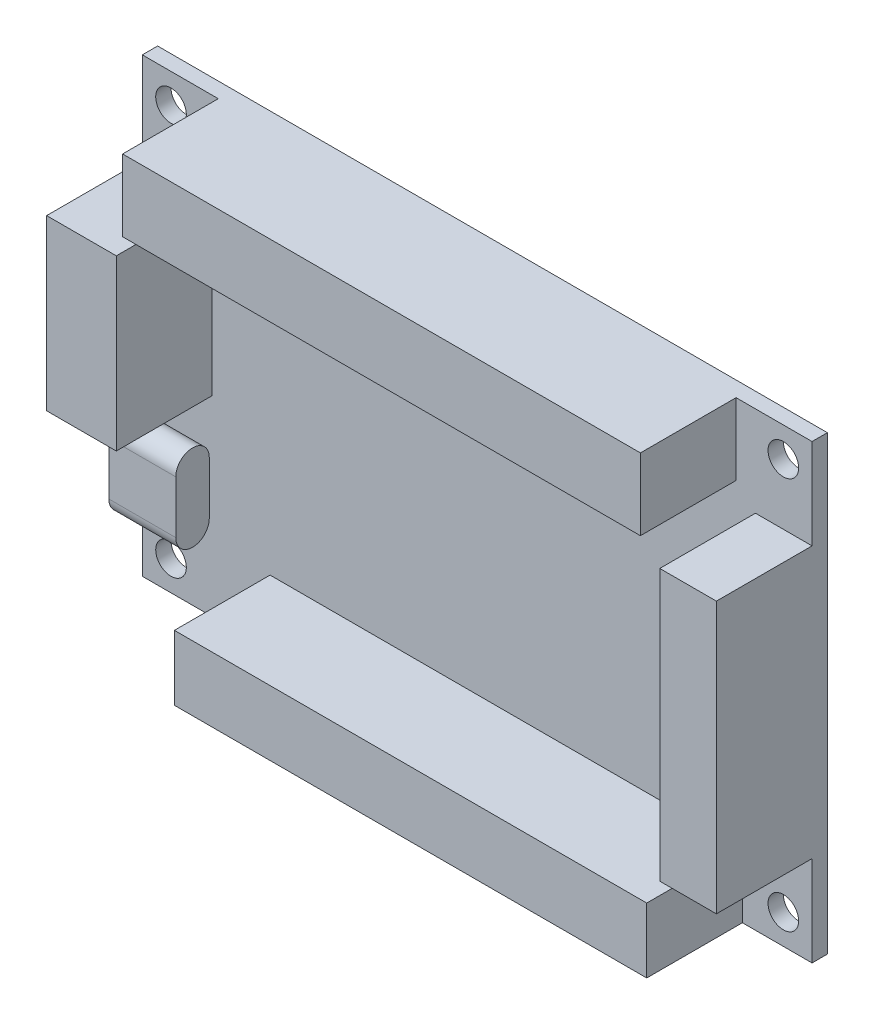
ISO-10303-21;
HEADER;
FILE_DESCRIPTION(('STEP AP214'),'2;1');
FILE_NAME('part.step','',(''),(''),'','','');
FILE_SCHEMA(('AUTOMOTIVE_DESIGN { 1 0 10303 214 1 1 1 1 }'));
ENDSEC;
DATA;
#1=APPLICATION_CONTEXT('core data for automotive mechanical design processes');
#2=APPLICATION_PROTOCOL_DEFINITION('international standard','automotive_design',2000,#1);
#3=PRODUCT_CONTEXT('',#1,'mechanical');
#4=PRODUCT('Part','Part','',(#3));
#5=PRODUCT_RELATED_PRODUCT_CATEGORY('part','',(#4));
#6=PRODUCT_DEFINITION_FORMATION('','',#4);
#7=PRODUCT_DEFINITION_CONTEXT('part definition',#1,'design');
#8=PRODUCT_DEFINITION('design','',#6,#7);
#9=PRODUCT_DEFINITION_SHAPE('','',#8);
#10=(LENGTH_UNIT() NAMED_UNIT(*) SI_UNIT(.MILLI.,.METRE.));
#11=(NAMED_UNIT(*) PLANE_ANGLE_UNIT() SI_UNIT($,.RADIAN.));
#12=(NAMED_UNIT(*) SI_UNIT($,.STERADIAN.) SOLID_ANGLE_UNIT());
#13=UNCERTAINTY_MEASURE_WITH_UNIT(LENGTH_MEASURE(1.E-05),#10,'distance_accuracy_value','');
#14=(GEOMETRIC_REPRESENTATION_CONTEXT(3) GLOBAL_UNCERTAINTY_ASSIGNED_CONTEXT((#13)) GLOBAL_UNIT_ASSIGNED_CONTEXT((#10,
#11,#12)) REPRESENTATION_CONTEXT('',''));
#15=CARTESIAN_POINT('',(0.,0.,0.));
#16=DIRECTION('',(0.,0.,1.));
#17=DIRECTION('',(1.,0.,0.));
#18=AXIS2_PLACEMENT_3D('',#15,#16,#17);
#19=CARTESIAN_POINT('',(0.,0.,1.6));
#20=DIRECTION('',(0.,0.,1.));
#21=DIRECTION('',(1.,0.,0.));
#22=AXIS2_PLACEMENT_3D('',#19,#20,#21);
#23=PLANE('',#22);
#24=DIRECTION('',(-1.,0.,0.));
#25=VECTOR('',#24,1.);
#26=CARTESIAN_POINT('',(-28.,-9.35,1.6));
#27=LINE('',#26,#25);
#28=CARTESIAN_POINT('',(-28.,-9.35,1.6));
#29=VERTEX_POINT('',#28);
#30=CARTESIAN_POINT('',(-35.,-9.35,1.6));
#31=VERTEX_POINT('',#30);
#32=EDGE_CURVE('E53',#29,#31,#27,.T.);
#33=ORIENTED_EDGE('',*,*,#32,.F.);
#34=DIRECTION('',(0.,-1.,0.));
#35=VECTOR('',#34,1.);
#36=CARTESIAN_POINT('',(-28.,-9.35,1.6));
#37=LINE('',#36,#35);
#38=CARTESIAN_POINT('',(-28.,-14.85,1.6));
#39=VERTEX_POINT('',#38);
#40=EDGE_CURVE('E48',#29,#39,#37,.T.);
#41=ORIENTED_EDGE('',*,*,#40,.T.);
#42=DIRECTION('',(-1.,0.,0.));
#43=VECTOR('',#42,1.);
#44=CARTESIAN_POINT('',(-28.,-14.85,1.6));
#45=LINE('',#44,#43);
#46=CARTESIAN_POINT('',(-35.,-14.85,1.6));
#47=VERTEX_POINT('',#46);
#48=EDGE_CURVE('E204',#39,#47,#45,.T.);
#49=ORIENTED_EDGE('',*,*,#48,.T.);
#50=DIRECTION('',(0.,-1.,0.));
#51=VECTOR('',#50,1.);
#52=CARTESIAN_POINT('',(-35.,23.6,1.6));
#53=LINE('',#52,#51);
#54=CARTESIAN_POINT('',(-35.,-23.6,1.6));
#55=VERTEX_POINT('',#54);
#56=EDGE_CURVE('E378',#47,#55,#53,.T.);
#57=ORIENTED_EDGE('',*,*,#56,.T.);
#58=DIRECTION('',(1.,0.,0.));
#59=VECTOR('',#58,1.);
#60=CARTESIAN_POINT('',(-35.,-23.6,1.6));
#61=LINE('',#60,#59);
#62=CARTESIAN_POINT('',(-21.6462553816328,-23.6,1.6));
#63=VERTEX_POINT('',#62);
#64=EDGE_CURVE('E383',#55,#63,#61,.T.);
#65=ORIENTED_EDGE('',*,*,#64,.T.);
#66=DIRECTION('',(0.,-1.,0.));
#67=VECTOR('',#66,1.);
#68=CARTESIAN_POINT('',(-21.6462553816328,-16.8142339307149,1.6));
#69=LINE('',#68,#67);
#70=CARTESIAN_POINT('',(-21.6462553816328,-16.8142339307149,1.6));
#71=VERTEX_POINT('',#70);
#72=EDGE_CURVE('E322',#71,#63,#69,.T.);
#73=ORIENTED_EDGE('',*,*,#72,.F.);
#74=DIRECTION('',(-1.,0.,0.));
#75=VECTOR('',#74,1.);
#76=CARTESIAN_POINT('',(-21.6462553816328,-16.8142339307149,1.6));
#77=LINE('',#76,#75);
#78=CARTESIAN_POINT('',(27.7201934755892,-16.8142339307149,1.6));
#79=VERTEX_POINT('',#78);
#80=EDGE_CURVE('E331',#79,#71,#77,.T.);
#81=ORIENTED_EDGE('',*,*,#80,.F.);
#82=DIRECTION('',(0.,1.,0.));
#83=VECTOR('',#82,1.);
#84=CARTESIAN_POINT('',(27.7201934755892,-16.8142339307149,1.6));
#85=LINE('',#84,#83);
#86=CARTESIAN_POINT('',(27.7201934755892,-23.6,1.6));
#87=VERTEX_POINT('',#86);
#88=EDGE_CURVE('E317',#87,#79,#85,.T.);
#89=ORIENTED_EDGE('',*,*,#88,.F.);
#90=CARTESIAN_POINT('',(35.,-23.6,1.6));
#91=VERTEX_POINT('',#90);
#92=EDGE_CURVE('E381',#87,#91,#61,.T.);
#93=ORIENTED_EDGE('',*,*,#92,.T.);
#94=DIRECTION('',(0.,1.,0.));
#95=VECTOR('',#94,1.);
#96=CARTESIAN_POINT('',(35.,23.6,1.6));
#97=LINE('',#96,#95);
#98=CARTESIAN_POINT('',(35.,-14.1534321184887,1.6));
#99=VERTEX_POINT('',#98);
#100=EDGE_CURVE('E372',#91,#99,#97,.T.);
#101=ORIENTED_EDGE('',*,*,#100,.T.);
#102=DIRECTION('',(1.,0.,0.));
#103=VECTOR('',#102,1.);
#104=CARTESIAN_POINT('',(29.0837837526944,-14.1534321184887,1.6));
#105=LINE('',#104,#103);
#106=CARTESIAN_POINT('',(29.0837837526944,-14.1534321184887,1.6));
#107=VERTEX_POINT('',#106);
#108=EDGE_CURVE('E262',#107,#99,#105,.T.);
#109=ORIENTED_EDGE('',*,*,#108,.F.);
#110=DIRECTION('',(0.,-1.,0.));
#111=VECTOR('',#110,1.);
#112=CARTESIAN_POINT('',(29.0837837526944,-14.1534321184887,1.6));
#113=LINE('',#112,#111);
#114=CARTESIAN_POINT('',(29.0837837526944,14.1534321184887,1.6));
#115=VERTEX_POINT('',#114);
#116=EDGE_CURVE('E271',#115,#107,#113,.T.);
#117=ORIENTED_EDGE('',*,*,#116,.F.);
#118=DIRECTION('',(-1.,0.,0.));
#119=VECTOR('',#118,1.);
#120=CARTESIAN_POINT('',(29.0837837526944,14.1534321184887,1.6));
#121=LINE('',#120,#119);
#122=CARTESIAN_POINT('',(35.,14.1534321184887,1.6));
#123=VERTEX_POINT('',#122);
#124=EDGE_CURVE('E257',#123,#115,#121,.T.);
#125=ORIENTED_EDGE('',*,*,#124,.F.);
#126=CARTESIAN_POINT('',(35.,23.6,1.6));
#127=VERTEX_POINT('',#126);
#128=EDGE_CURVE('E375',#123,#127,#97,.T.);
#129=ORIENTED_EDGE('',*,*,#128,.T.);
#130=DIRECTION('',(-1.,0.,0.));
#131=VECTOR('',#130,1.);
#132=CARTESIAN_POINT('',(-35.,23.6,1.6));
#133=LINE('',#132,#131);
#134=CARTESIAN_POINT('',(27.0601888690275,23.6,1.6));
#135=VERTEX_POINT('',#134);
#136=EDGE_CURVE('E376',#127,#135,#133,.T.);
#137=ORIENTED_EDGE('',*,*,#136,.T.);
#138=DIRECTION('',(0.,1.,0.));
#139=VECTOR('',#138,1.);
#140=CARTESIAN_POINT('',(27.0601888690275,16.1036087033518,1.6));
#141=LINE('',#140,#139);
#142=CARTESIAN_POINT('',(27.0601888690275,16.1036087033518,1.6));
#143=VERTEX_POINT('',#142);
#144=EDGE_CURVE('E287',#143,#135,#141,.T.);
#145=ORIENTED_EDGE('',*,*,#144,.F.);
#146=DIRECTION('',(1.,0.,0.));
#147=VECTOR('',#146,1.);
#148=CARTESIAN_POINT('',(-27.0601888690275,16.1036087033518,1.6));
#149=LINE('',#148,#147);
#150=CARTESIAN_POINT('',(-27.0601888690275,16.1036087033518,1.6));
#151=VERTEX_POINT('',#150);
#152=EDGE_CURVE('E292',#151,#143,#149,.T.);
#153=ORIENTED_EDGE('',*,*,#152,.F.);
#154=DIRECTION('',(0.,-1.,0.));
#155=VECTOR('',#154,1.);
#156=CARTESIAN_POINT('',(-27.0601888690275,16.1036087033518,1.6));
#157=LINE('',#156,#155);
#158=CARTESIAN_POINT('',(-27.0601888690275,23.6,1.6));
#159=VERTEX_POINT('',#158);
#160=EDGE_CURVE('E301',#159,#151,#157,.T.);
#161=ORIENTED_EDGE('',*,*,#160,.F.);
#162=CARTESIAN_POINT('',(-35.,23.6,1.6));
#163=VERTEX_POINT('',#162);
#164=EDGE_CURVE('E374',#159,#163,#133,.T.);
#165=ORIENTED_EDGE('',*,*,#164,.T.);
#166=CARTESIAN_POINT('',(-35.,14.0486711566723,1.6));
#167=VERTEX_POINT('',#166);
#168=EDGE_CURVE('E379',#163,#167,#53,.T.);
#169=ORIENTED_EDGE('',*,*,#168,.T.);
#170=DIRECTION('',(-1.,0.,0.));
#171=VECTOR('',#170,1.);
#172=CARTESIAN_POINT('',(-27.7201934755892,14.0486711566723,1.6));
#173=LINE('',#172,#171);
#174=CARTESIAN_POINT('',(-27.7201934755892,14.0486711566723,1.6));
#175=VERTEX_POINT('',#174);
#176=EDGE_CURVE('E232',#175,#167,#173,.T.);
#177=ORIENTED_EDGE('',*,*,#176,.F.);
#178=DIRECTION('',(0.,1.,0.));
#179=VECTOR('',#178,1.);
#180=CARTESIAN_POINT('',(-27.7201934755892,-3.62126385209027,1.6));
#181=LINE('',#180,#179);
#182=CARTESIAN_POINT('',(-27.7201934755892,-3.62126385209027,1.6));
#183=VERTEX_POINT('',#182);
#184=EDGE_CURVE('E241',#183,#175,#181,.T.);
#185=ORIENTED_EDGE('',*,*,#184,.F.);
#186=DIRECTION('',(1.,0.,0.));
#187=VECTOR('',#186,1.);
#188=CARTESIAN_POINT('',(-27.7201934755892,-3.62126385209027,1.6));
#189=LINE('',#188,#187);
#190=CARTESIAN_POINT('',(-35.,-3.62126385209028,1.6));
#191=VERTEX_POINT('',#190);
#192=EDGE_CURVE('E225',#191,#183,#189,.T.);
#193=ORIENTED_EDGE('',*,*,#192,.F.);
#194=EDGE_CURVE('E382',#191,#31,#53,.T.);
#195=ORIENTED_EDGE('',*,*,#194,.T.);
#196=EDGE_LOOP('',(#33,#41,#49,#57,#65,#73,#81,#89,#93,#101,#109,#117,#125,#129,#137,#145,#153,
#161,#165,#169,#177,#185,#193,#195));
#197=FACE_BOUND('',#196,.T.);
#198=CARTESIAN_POINT('',(32.,-20.5,1.6));
#199=DIRECTION('',(0.,0.,1.));
#200=DIRECTION('',(1.,0.,0.));
#201=AXIS2_PLACEMENT_3D('',#198,#199,#200);
#202=CIRCLE('',#201,1.6);
#203=CARTESIAN_POINT('',(33.6,-20.5,1.6));
#204=VERTEX_POINT('',#203);
#205=EDGE_CURVE('E354',#204,#204,#202,.T.);
#206=ORIENTED_EDGE('',*,*,#205,.F.);
#207=EDGE_LOOP('',(#206));
#208=FACE_BOUND('',#207,.T.);
#209=CARTESIAN_POINT('',(-32.,20.5,1.6));
#210=DIRECTION('',(0.,0.,1.));
#211=DIRECTION('',(1.,0.,0.));
#212=AXIS2_PLACEMENT_3D('',#209,#210,#211);
#213=CIRCLE('',#212,1.6);
#214=CARTESIAN_POINT('',(-30.4,20.5,1.6));
#215=VERTEX_POINT('',#214);
#216=EDGE_CURVE('E366',#215,#215,#213,.T.);
#217=ORIENTED_EDGE('',*,*,#216,.F.);
#218=EDGE_LOOP('',(#217));
#219=FACE_BOUND('',#218,.T.);
#220=CARTESIAN_POINT('',(32.,20.5,1.6));
#221=DIRECTION('',(0.,0.,1.));
#222=DIRECTION('',(-1.,0.,0.));
#223=AXIS2_PLACEMENT_3D('',#220,#221,#222);
#224=CIRCLE('',#223,1.6);
#225=CARTESIAN_POINT('',(30.4,20.5,1.6));
#226=VERTEX_POINT('',#225);
#227=EDGE_CURVE('E360',#226,#226,#224,.T.);
#228=ORIENTED_EDGE('',*,*,#227,.F.);
#229=EDGE_LOOP('',(#228));
#230=FACE_BOUND('',#229,.T.);
#231=CARTESIAN_POINT('',(-32.,-20.5,1.6));
#232=DIRECTION('',(0.,0.,1.));
#233=DIRECTION('',(-1.,0.,0.));
#234=AXIS2_PLACEMENT_3D('',#231,#232,#233);
#235=CIRCLE('',#234,1.6);
#236=CARTESIAN_POINT('',(-33.6,-20.5,1.6));
#237=VERTEX_POINT('',#236);
#238=EDGE_CURVE('E348',#237,#237,#235,.T.);
#239=ORIENTED_EDGE('',*,*,#238,.F.);
#240=EDGE_LOOP('',(#239));
#241=FACE_BOUND('',#240,.T.);
#242=ADVANCED_FACE('F33',(#197,#208,#219,#230,#241),#23,.T.);
#243=CARTESIAN_POINT('',(0.,0.,0.));
#244=DIRECTION('',(0.,0.,1.));
#245=DIRECTION('',(1.,0.,0.));
#246=AXIS2_PLACEMENT_3D('',#243,#244,#245);
#247=PLANE('',#246);
#248=DIRECTION('',(0.,1.,0.));
#249=VECTOR('',#248,1.);
#250=CARTESIAN_POINT('',(35.,23.6,0.));
#251=LINE('',#250,#249);
#252=CARTESIAN_POINT('',(35.,-23.6,0.));
#253=VERTEX_POINT('',#252);
#254=CARTESIAN_POINT('',(35.,23.6,0.));
#255=VERTEX_POINT('',#254);
#256=EDGE_CURVE('E369',#253,#255,#251,.T.);
#257=ORIENTED_EDGE('',*,*,#256,.F.);
#258=DIRECTION('',(1.,0.,0.));
#259=VECTOR('',#258,1.);
#260=CARTESIAN_POINT('',(-35.,-23.6,0.));
#261=LINE('',#260,#259);
#262=CARTESIAN_POINT('',(-35.,-23.6,0.));
#263=VERTEX_POINT('',#262);
#264=EDGE_CURVE('E392',#263,#253,#261,.T.);
#265=ORIENTED_EDGE('',*,*,#264,.F.);
#266=DIRECTION('',(0.,-1.,0.));
#267=VECTOR('',#266,1.);
#268=CARTESIAN_POINT('',(-35.,23.6,0.));
#269=LINE('',#268,#267);
#270=CARTESIAN_POINT('',(-35.,23.6,0.));
#271=VERTEX_POINT('',#270);
#272=EDGE_CURVE('E390',#271,#263,#269,.T.);
#273=ORIENTED_EDGE('',*,*,#272,.F.);
#274=DIRECTION('',(-1.,0.,0.));
#275=VECTOR('',#274,1.);
#276=CARTESIAN_POINT('',(-35.,23.6,0.));
#277=LINE('',#276,#275);
#278=EDGE_CURVE('E388',#255,#271,#277,.T.);
#279=ORIENTED_EDGE('',*,*,#278,.F.);
#280=EDGE_LOOP('',(#257,#265,#273,#279));
#281=FACE_BOUND('',#280,.T.);
#282=CARTESIAN_POINT('',(-32.,20.5,0.));
#283=DIRECTION('',(0.,0.,1.));
#284=DIRECTION('',(1.,0.,0.));
#285=AXIS2_PLACEMENT_3D('',#282,#283,#284);
#286=CIRCLE('',#285,1.6);
#287=CARTESIAN_POINT('',(-30.4,20.5,0.));
#288=VERTEX_POINT('',#287);
#289=EDGE_CURVE('E363',#288,#288,#286,.T.);
#290=ORIENTED_EDGE('',*,*,#289,.T.);
#291=EDGE_LOOP('',(#290));
#292=FACE_BOUND('',#291,.T.);
#293=CARTESIAN_POINT('',(32.,20.5,0.));
#294=DIRECTION('',(0.,0.,1.));
#295=DIRECTION('',(-1.,0.,0.));
#296=AXIS2_PLACEMENT_3D('',#293,#294,#295);
#297=CIRCLE('',#296,1.6);
#298=CARTESIAN_POINT('',(30.4,20.5,0.));
#299=VERTEX_POINT('',#298);
#300=EDGE_CURVE('E357',#299,#299,#297,.T.);
#301=ORIENTED_EDGE('',*,*,#300,.T.);
#302=EDGE_LOOP('',(#301));
#303=FACE_BOUND('',#302,.T.);
#304=CARTESIAN_POINT('',(32.,-20.5,0.));
#305=DIRECTION('',(0.,0.,1.));
#306=DIRECTION('',(1.,0.,0.));
#307=AXIS2_PLACEMENT_3D('',#304,#305,#306);
#308=CIRCLE('',#307,1.6);
#309=CARTESIAN_POINT('',(33.6,-20.5,0.));
#310=VERTEX_POINT('',#309);
#311=EDGE_CURVE('E351',#310,#310,#308,.T.);
#312=ORIENTED_EDGE('',*,*,#311,.T.);
#313=EDGE_LOOP('',(#312));
#314=FACE_BOUND('',#313,.T.);
#315=CARTESIAN_POINT('',(-32.,-20.5,0.));
#316=DIRECTION('',(0.,0.,1.));
#317=DIRECTION('',(-1.,0.,0.));
#318=AXIS2_PLACEMENT_3D('',#315,#316,#317);
#319=CIRCLE('',#318,1.6);
#320=CARTESIAN_POINT('',(-33.6,-20.5,0.));
#321=VERTEX_POINT('',#320);
#322=EDGE_CURVE('E347',#321,#321,#319,.T.);
#323=ORIENTED_EDGE('',*,*,#322,.T.);
#324=EDGE_LOOP('',(#323));
#325=FACE_BOUND('',#324,.T.);
#326=ADVANCED_FACE('F409',(#281,#292,#303,#314,#325),#247,.F.);
#327=CARTESIAN_POINT('',(35.,23.6,1.6));
#328=DIRECTION('',(-1.,0.,0.));
#329=DIRECTION('',(0.,-1.,0.));
#330=AXIS2_PLACEMENT_3D('',#327,#328,#329);
#331=PLANE('',#330);
#332=ORIENTED_EDGE('',*,*,#256,.T.);
#333=DIRECTION('',(0.,0.,-1.));
#334=VECTOR('',#333,1.);
#335=CARTESIAN_POINT('',(35.,23.6,1.6));
#336=LINE('',#335,#334);
#337=EDGE_CURVE('E11',#127,#255,#336,.T.);
#338=ORIENTED_EDGE('',*,*,#337,.F.);
#339=ORIENTED_EDGE('',*,*,#128,.F.);
#340=DIRECTION('',(0.,0.,-1.));
#341=VECTOR('',#340,1.);
#342=CARTESIAN_POINT('',(35.,14.1534321184887,11.6));
#343=LINE('',#342,#341);
#344=CARTESIAN_POINT('',(35.,14.1534321184887,11.6));
#345=VERTEX_POINT('',#344);
#346=EDGE_CURVE('E284',#345,#123,#343,.T.);
#347=ORIENTED_EDGE('',*,*,#346,.F.);
#348=DIRECTION('',(0.,1.,0.));
#349=VECTOR('',#348,1.);
#350=CARTESIAN_POINT('',(35.,-14.1534321184887,11.6));
#351=LINE('',#350,#349);
#352=CARTESIAN_POINT('',(35.,-14.1534321184887,11.6));
#353=VERTEX_POINT('',#352);
#354=EDGE_CURVE('E258',#353,#345,#351,.T.);
#355=ORIENTED_EDGE('',*,*,#354,.F.);
#356=DIRECTION('',(0.,0.,-1.));
#357=VECTOR('',#356,1.);
#358=CARTESIAN_POINT('',(35.,-14.1534321184887,11.6));
#359=LINE('',#358,#357);
#360=EDGE_CURVE('E268',#353,#99,#359,.T.);
#361=ORIENTED_EDGE('',*,*,#360,.T.);
#362=ORIENTED_EDGE('',*,*,#100,.F.);
#363=DIRECTION('',(0.,0.,-1.));
#364=VECTOR('',#363,1.);
#365=CARTESIAN_POINT('',(35.,-23.6,1.6));
#366=LINE('',#365,#364);
#367=EDGE_CURVE('E385',#91,#253,#366,.T.);
#368=ORIENTED_EDGE('',*,*,#367,.T.);
#369=EDGE_LOOP('',(#332,#338,#339,#347,#355,#361,#362,#368));
#370=FACE_BOUND('',#369,.T.);
#371=ADVANCED_FACE('F35',(#370),#331,.F.);
#372=CARTESIAN_POINT('',(-35.,23.6,1.6));
#373=DIRECTION('',(0.,-1.,0.));
#374=DIRECTION('',(0.,0.,-1.));
#375=AXIS2_PLACEMENT_3D('',#372,#373,#374);
#376=PLANE('',#375);
#377=ORIENTED_EDGE('',*,*,#278,.T.);
#378=DIRECTION('',(0.,0.,-1.));
#379=VECTOR('',#378,1.);
#380=CARTESIAN_POINT('',(-35.,23.6,1.6));
#381=LINE('',#380,#379);
#382=EDGE_CURVE('E41',#163,#271,#381,.T.);
#383=ORIENTED_EDGE('',*,*,#382,.F.);
#384=ORIENTED_EDGE('',*,*,#164,.F.);
#385=DIRECTION('',(0.,0.,-1.));
#386=VECTOR('',#385,1.);
#387=CARTESIAN_POINT('',(-27.0601888690275,23.6,11.6));
#388=LINE('',#387,#386);
#389=CARTESIAN_POINT('',(-27.0601888690275,23.6,11.6));
#390=VERTEX_POINT('',#389);
#391=EDGE_CURVE('E311',#390,#159,#388,.T.);
#392=ORIENTED_EDGE('',*,*,#391,.F.);
#393=DIRECTION('',(-1.,0.,0.));
#394=VECTOR('',#393,1.);
#395=CARTESIAN_POINT('',(-27.0601888690275,23.6,11.6));
#396=LINE('',#395,#394);
#397=CARTESIAN_POINT('',(27.0601888690275,23.6,11.6));
#398=VERTEX_POINT('',#397);
#399=EDGE_CURVE('E291',#398,#390,#396,.T.);
#400=ORIENTED_EDGE('',*,*,#399,.F.);
#401=DIRECTION('',(0.,0.,-1.));
#402=VECTOR('',#401,1.);
#403=CARTESIAN_POINT('',(27.0601888690275,23.6,11.6));
#404=LINE('',#403,#402);
#405=EDGE_CURVE('E314',#398,#135,#404,.T.);
#406=ORIENTED_EDGE('',*,*,#405,.T.);
#407=ORIENTED_EDGE('',*,*,#136,.F.);
#408=ORIENTED_EDGE('',*,*,#337,.T.);
#409=EDGE_LOOP('',(#377,#383,#384,#392,#400,#406,#407,#408));
#410=FACE_BOUND('',#409,.T.);
#411=ADVANCED_FACE('F435',(#410),#376,.F.);
#412=CARTESIAN_POINT('',(-35.,23.6,1.6));
#413=DIRECTION('',(1.,0.,0.));
#414=DIRECTION('',(0.,1.,0.));
#415=AXIS2_PLACEMENT_3D('',#412,#413,#414);
#416=PLANE('',#415);
#417=ORIENTED_EDGE('',*,*,#272,.T.);
#418=DIRECTION('',(0.,0.,-1.));
#419=VECTOR('',#418,1.);
#420=CARTESIAN_POINT('',(-35.,-23.6,1.6));
#421=LINE('',#420,#419);
#422=EDGE_CURVE('E396',#55,#263,#421,.T.);
#423=ORIENTED_EDGE('',*,*,#422,.F.);
#424=ORIENTED_EDGE('',*,*,#56,.F.);
#425=CARTESIAN_POINT('',(-35.,-14.85,3.35));
#426=DIRECTION('',(-1.,0.,0.));
#427=DIRECTION('',(0.,0.,1.));
#428=AXIS2_PLACEMENT_3D('',#425,#426,#427);
#429=CIRCLE('',#428,1.75);
#430=CARTESIAN_POINT('',(-35.,-14.85,5.1));
#431=VERTEX_POINT('',#430);
#432=EDGE_CURVE('E222',#47,#431,#429,.T.);
#433=ORIENTED_EDGE('',*,*,#432,.T.);
#434=DIRECTION('',(0.,1.,0.));
#435=VECTOR('',#434,1.);
#436=CARTESIAN_POINT('',(-35.,-9.35,5.1));
#437=LINE('',#436,#435);
#438=CARTESIAN_POINT('',(-35.,-9.35,5.1));
#439=VERTEX_POINT('',#438);
#440=EDGE_CURVE('E199',#431,#439,#437,.T.);
#441=ORIENTED_EDGE('',*,*,#440,.T.);
#442=CARTESIAN_POINT('',(-35.,-9.35,3.35));
#443=DIRECTION('',(-1.,0.,0.));
#444=DIRECTION('',(0.,0.,1.));
#445=AXIS2_PLACEMENT_3D('',#442,#443,#444);
#446=CIRCLE('',#445,1.75);
#447=EDGE_CURVE('E219',#439,#31,#446,.T.);
#448=ORIENTED_EDGE('',*,*,#447,.T.);
#449=ORIENTED_EDGE('',*,*,#194,.F.);
#450=DIRECTION('',(0.,0.,-1.));
#451=VECTOR('',#450,1.);
#452=CARTESIAN_POINT('',(-35.,-3.62126385209028,11.6));
#453=LINE('',#452,#451);
#454=CARTESIAN_POINT('',(-35.,-3.62126385209028,11.6));
#455=VERTEX_POINT('',#454);
#456=EDGE_CURVE('E254',#455,#191,#453,.T.);
#457=ORIENTED_EDGE('',*,*,#456,.F.);
#458=DIRECTION('',(0.,-1.,0.));
#459=VECTOR('',#458,1.);
#460=CARTESIAN_POINT('',(-35.,-3.62126385209028,11.6));
#461=LINE('',#460,#459);
#462=CARTESIAN_POINT('',(-35.,14.0486711566723,11.6));
#463=VERTEX_POINT('',#462);
#464=EDGE_CURVE('E228',#463,#455,#461,.T.);
#465=ORIENTED_EDGE('',*,*,#464,.F.);
#466=DIRECTION('',(0.,0.,-1.));
#467=VECTOR('',#466,1.);
#468=CARTESIAN_POINT('',(-35.,14.0486711566723,11.6));
#469=LINE('',#468,#467);
#470=EDGE_CURVE('E238',#463,#167,#469,.T.);
#471=ORIENTED_EDGE('',*,*,#470,.T.);
#472=ORIENTED_EDGE('',*,*,#168,.F.);
#473=ORIENTED_EDGE('',*,*,#382,.T.);
#474=EDGE_LOOP('',(#417,#423,#424,#433,#441,#448,#449,#457,#465,#471,#472,#473));
#475=FACE_BOUND('',#474,.T.);
#476=ADVANCED_FACE('F403',(#475),#416,.F.);
#477=CARTESIAN_POINT('',(-35.,-23.6,1.6));
#478=DIRECTION('',(0.,1.,0.));
#479=DIRECTION('',(0.,0.,1.));
#480=AXIS2_PLACEMENT_3D('',#477,#478,#479);
#481=PLANE('',#480);
#482=ORIENTED_EDGE('',*,*,#264,.T.);
#483=ORIENTED_EDGE('',*,*,#367,.F.);
#484=ORIENTED_EDGE('',*,*,#92,.F.);
#485=DIRECTION('',(0.,0.,-1.));
#486=VECTOR('',#485,1.);
#487=CARTESIAN_POINT('',(27.7201934755892,-23.6,11.6));
#488=LINE('',#487,#486);
#489=CARTESIAN_POINT('',(27.7201934755892,-23.6,11.6));
#490=VERTEX_POINT('',#489);
#491=EDGE_CURVE('E328',#490,#87,#488,.T.);
#492=ORIENTED_EDGE('',*,*,#491,.F.);
#493=DIRECTION('',(1.,0.,0.));
#494=VECTOR('',#493,1.);
#495=CARTESIAN_POINT('',(-21.6462553816328,-23.6,11.6));
#496=LINE('',#495,#494);
#497=CARTESIAN_POINT('',(-21.6462553816328,-23.6,11.6));
#498=VERTEX_POINT('',#497);
#499=EDGE_CURVE('E326',#498,#490,#496,.T.);
#500=ORIENTED_EDGE('',*,*,#499,.F.);
#501=DIRECTION('',(0.,0.,-1.));
#502=VECTOR('',#501,1.);
#503=CARTESIAN_POINT('',(-21.6462553816328,-23.6,11.6));
#504=LINE('',#503,#502);
#505=EDGE_CURVE('E338',#498,#63,#504,.T.);
#506=ORIENTED_EDGE('',*,*,#505,.T.);
#507=ORIENTED_EDGE('',*,*,#64,.F.);
#508=ORIENTED_EDGE('',*,*,#422,.T.);
#509=EDGE_LOOP('',(#482,#483,#484,#492,#500,#506,#507,#508));
#510=FACE_BOUND('',#509,.T.);
#511=ADVANCED_FACE('F413',(#510),#481,.F.);
#512=CARTESIAN_POINT('',(-32.,20.5,1.6));
#513=DIRECTION('',(0.,0.,-1.));
#514=DIRECTION('',(-1.,0.,0.));
#515=AXIS2_PLACEMENT_3D('',#512,#513,#514);
#516=CYLINDRICAL_SURFACE('',#515,1.6);
#517=ORIENTED_EDGE('',*,*,#216,.T.);
#518=EDGE_LOOP('',(#517));
#519=FACE_BOUND('',#518,.T.);
#520=ORIENTED_EDGE('',*,*,#289,.F.);
#521=EDGE_LOOP('',(#520));
#522=FACE_BOUND('',#521,.T.);
#523=ADVANCED_FACE('F483',(#519,#522),#516,.F.);
#524=CARTESIAN_POINT('',(32.,20.5,1.6));
#525=DIRECTION('',(0.,0.,-1.));
#526=DIRECTION('',(-1.,0.,0.));
#527=AXIS2_PLACEMENT_3D('',#524,#525,#526);
#528=CYLINDRICAL_SURFACE('',#527,1.6);
#529=ORIENTED_EDGE('',*,*,#227,.T.);
#530=EDGE_LOOP('',(#529));
#531=FACE_BOUND('',#530,.T.);
#532=ORIENTED_EDGE('',*,*,#300,.F.);
#533=EDGE_LOOP('',(#532));
#534=FACE_BOUND('',#533,.T.);
#535=ADVANCED_FACE('F510',(#531,#534),#528,.F.);
#536=CARTESIAN_POINT('',(32.,-20.5,1.6));
#537=DIRECTION('',(0.,0.,-1.));
#538=DIRECTION('',(-1.,0.,0.));
#539=AXIS2_PLACEMENT_3D('',#536,#537,#538);
#540=CYLINDRICAL_SURFACE('',#539,1.6);
#541=ORIENTED_EDGE('',*,*,#205,.T.);
#542=EDGE_LOOP('',(#541));
#543=FACE_BOUND('',#542,.T.);
#544=ORIENTED_EDGE('',*,*,#311,.F.);
#545=EDGE_LOOP('',(#544));
#546=FACE_BOUND('',#545,.T.);
#547=ADVANCED_FACE('F520',(#543,#546),#540,.F.);
#548=CARTESIAN_POINT('',(-32.,-20.5,1.6));
#549=DIRECTION('',(0.,0.,-1.));
#550=DIRECTION('',(-1.,0.,0.));
#551=AXIS2_PLACEMENT_3D('',#548,#549,#550);
#552=CYLINDRICAL_SURFACE('',#551,1.6);
#553=ORIENTED_EDGE('',*,*,#238,.T.);
#554=EDGE_LOOP('',(#553));
#555=FACE_BOUND('',#554,.T.);
#556=ORIENTED_EDGE('',*,*,#322,.F.);
#557=EDGE_LOOP('',(#556));
#558=FACE_BOUND('',#557,.T.);
#559=ADVANCED_FACE('F528',(#555,#558),#552,.F.);
#560=CARTESIAN_POINT('',(27.7201934755892,-16.8142339307149,11.6));
#561=DIRECTION('',(-1.,0.,0.));
#562=DIRECTION('',(0.,0.,1.));
#563=AXIS2_PLACEMENT_3D('',#560,#561,#562);
#564=PLANE('',#563);
#565=ORIENTED_EDGE('',*,*,#88,.T.);
#566=DIRECTION('',(0.,0.,-1.));
#567=VECTOR('',#566,1.);
#568=CARTESIAN_POINT('',(27.7201934755892,-16.8142339307149,11.6));
#569=LINE('',#568,#567);
#570=CARTESIAN_POINT('',(27.7201934755892,-16.8142339307149,11.6));
#571=VERTEX_POINT('',#570);
#572=EDGE_CURVE('E344',#571,#79,#569,.T.);
#573=ORIENTED_EDGE('',*,*,#572,.F.);
#574=DIRECTION('',(0.,1.,0.));
#575=VECTOR('',#574,1.);
#576=CARTESIAN_POINT('',(27.7201934755892,-16.8142339307149,11.6));
#577=LINE('',#576,#575);
#578=EDGE_CURVE('E318',#490,#571,#577,.T.);
#579=ORIENTED_EDGE('',*,*,#578,.F.);
#580=ORIENTED_EDGE('',*,*,#491,.T.);
#581=EDGE_LOOP('',(#565,#573,#579,#580));
#582=FACE_BOUND('',#581,.T.);
#583=ADVANCED_FACE('F537',(#582),#564,.F.);
#584=CARTESIAN_POINT('',(-21.6462553816328,-16.8142339307149,11.6));
#585=DIRECTION('',(0.,-1.,0.));
#586=DIRECTION('',(0.,0.,-1.));
#587=AXIS2_PLACEMENT_3D('',#584,#585,#586);
#588=PLANE('',#587);
#589=ORIENTED_EDGE('',*,*,#80,.T.);
#590=DIRECTION('',(0.,0.,-1.));
#591=VECTOR('',#590,1.);
#592=CARTESIAN_POINT('',(-21.6462553816328,-16.8142339307149,11.6));
#593=LINE('',#592,#591);
#594=CARTESIAN_POINT('',(-21.6462553816328,-16.8142339307149,11.6));
#595=VERTEX_POINT('',#594);
#596=EDGE_CURVE('E341',#595,#71,#593,.T.);
#597=ORIENTED_EDGE('',*,*,#596,.F.);
#598=DIRECTION('',(-1.,0.,0.));
#599=VECTOR('',#598,1.);
#600=CARTESIAN_POINT('',(-21.6462553816328,-16.8142339307149,11.6));
#601=LINE('',#600,#599);
#602=EDGE_CURVE('E321',#571,#595,#601,.T.);
#603=ORIENTED_EDGE('',*,*,#602,.F.);
#604=ORIENTED_EDGE('',*,*,#572,.T.);
#605=EDGE_LOOP('',(#589,#597,#603,#604));
#606=FACE_BOUND('',#605,.T.);
#607=ADVANCED_FACE('F548',(#606),#588,.F.);
#608=CARTESIAN_POINT('',(-21.6462553816328,-16.8142339307149,11.6));
#609=DIRECTION('',(1.,0.,0.));
#610=DIRECTION('',(0.,0.,-1.));
#611=AXIS2_PLACEMENT_3D('',#608,#609,#610);
#612=PLANE('',#611);
#613=ORIENTED_EDGE('',*,*,#72,.T.);
#614=ORIENTED_EDGE('',*,*,#505,.F.);
#615=DIRECTION('',(0.,-1.,0.));
#616=VECTOR('',#615,1.);
#617=CARTESIAN_POINT('',(-21.6462553816328,-16.8142339307149,11.6));
#618=LINE('',#617,#616);
#619=EDGE_CURVE('E324',#595,#498,#618,.T.);
#620=ORIENTED_EDGE('',*,*,#619,.F.);
#621=ORIENTED_EDGE('',*,*,#596,.T.);
#622=EDGE_LOOP('',(#613,#614,#620,#621));
#623=FACE_BOUND('',#622,.T.);
#624=ADVANCED_FACE('F557',(#623),#612,.F.);
#625=CARTESIAN_POINT('',(0.,0.,11.6));
#626=DIRECTION('',(0.,0.,1.));
#627=DIRECTION('',(1.,0.,0.));
#628=AXIS2_PLACEMENT_3D('',#625,#626,#627);
#629=PLANE('',#628);
#630=ORIENTED_EDGE('',*,*,#578,.T.);
#631=ORIENTED_EDGE('',*,*,#602,.T.);
#632=ORIENTED_EDGE('',*,*,#619,.T.);
#633=ORIENTED_EDGE('',*,*,#499,.T.);
#634=EDGE_LOOP('',(#630,#631,#632,#633));
#635=FACE_BOUND('',#634,.T.);
#636=ADVANCED_FACE('F565',(#635),#629,.T.);
#637=CARTESIAN_POINT('',(27.0601888690275,16.1036087033518,11.6));
#638=DIRECTION('',(-1.,0.,0.));
#639=DIRECTION('',(0.,0.,1.));
#640=AXIS2_PLACEMENT_3D('',#637,#638,#639);
#641=PLANE('',#640);
#642=ORIENTED_EDGE('',*,*,#144,.T.);
#643=ORIENTED_EDGE('',*,*,#405,.F.);
#644=DIRECTION('',(0.,1.,0.));
#645=VECTOR('',#644,1.);
#646=CARTESIAN_POINT('',(27.0601888690275,16.1036087033518,11.6));
#647=LINE('',#646,#645);
#648=CARTESIAN_POINT('',(27.0601888690275,16.1036087033518,11.6));
#649=VERTEX_POINT('',#648);
#650=EDGE_CURVE('E288',#649,#398,#647,.T.);
#651=ORIENTED_EDGE('',*,*,#650,.F.);
#652=DIRECTION('',(0.,0.,-1.));
#653=VECTOR('',#652,1.);
#654=CARTESIAN_POINT('',(27.0601888690275,16.1036087033518,11.6));
#655=LINE('',#654,#653);
#656=EDGE_CURVE('E298',#649,#143,#655,.T.);
#657=ORIENTED_EDGE('',*,*,#656,.T.);
#658=EDGE_LOOP('',(#642,#643,#651,#657));
#659=FACE_BOUND('',#658,.T.);
#660=ADVANCED_FACE('F440',(#659),#641,.F.);
#661=CARTESIAN_POINT('',(-27.0601888690275,16.1036087033518,11.6));
#662=DIRECTION('',(1.,0.,0.));
#663=DIRECTION('',(0.,0.,-1.));
#664=AXIS2_PLACEMENT_3D('',#661,#662,#663);
#665=PLANE('',#664);
#666=ORIENTED_EDGE('',*,*,#160,.T.);
#667=DIRECTION('',(0.,0.,-1.));
#668=VECTOR('',#667,1.);
#669=CARTESIAN_POINT('',(-27.0601888690275,16.1036087033518,11.6));
#670=LINE('',#669,#668);
#671=CARTESIAN_POINT('',(-27.0601888690275,16.1036087033518,11.6));
#672=VERTEX_POINT('',#671);
#673=EDGE_CURVE('E308',#672,#151,#670,.T.);
#674=ORIENTED_EDGE('',*,*,#673,.F.);
#675=DIRECTION('',(0.,-1.,0.));
#676=VECTOR('',#675,1.);
#677=CARTESIAN_POINT('',(-27.0601888690275,16.1036087033518,11.6));
#678=LINE('',#677,#676);
#679=EDGE_CURVE('E294',#390,#672,#678,.T.);
#680=ORIENTED_EDGE('',*,*,#679,.F.);
#681=ORIENTED_EDGE('',*,*,#391,.T.);
#682=EDGE_LOOP('',(#666,#674,#680,#681));
#683=FACE_BOUND('',#682,.T.);
#684=ADVANCED_FACE('F449',(#683),#665,.F.);
#685=CARTESIAN_POINT('',(-27.0601888690275,16.1036087033518,11.6));
#686=DIRECTION('',(0.,1.,0.));
#687=DIRECTION('',(0.,0.,1.));
#688=AXIS2_PLACEMENT_3D('',#685,#686,#687);
#689=PLANE('',#688);
#690=ORIENTED_EDGE('',*,*,#152,.T.);
#691=ORIENTED_EDGE('',*,*,#656,.F.);
#692=DIRECTION('',(1.,0.,0.));
#693=VECTOR('',#692,1.);
#694=CARTESIAN_POINT('',(-27.0601888690275,16.1036087033518,11.6));
#695=LINE('',#694,#693);
#696=EDGE_CURVE('E296',#672,#649,#695,.T.);
#697=ORIENTED_EDGE('',*,*,#696,.F.);
#698=ORIENTED_EDGE('',*,*,#673,.T.);
#699=EDGE_LOOP('',(#690,#691,#697,#698));
#700=FACE_BOUND('',#699,.T.);
#701=ADVANCED_FACE('F444',(#700),#689,.F.);
#702=CARTESIAN_POINT('',(0.,0.,11.6));
#703=DIRECTION('',(0.,0.,-1.));
#704=DIRECTION('',(-1.,0.,0.));
#705=AXIS2_PLACEMENT_3D('',#702,#703,#704);
#706=PLANE('',#705);
#707=ORIENTED_EDGE('',*,*,#650,.T.);
#708=ORIENTED_EDGE('',*,*,#399,.T.);
#709=ORIENTED_EDGE('',*,*,#679,.T.);
#710=ORIENTED_EDGE('',*,*,#696,.T.);
#711=EDGE_LOOP('',(#707,#708,#709,#710));
#712=FACE_BOUND('',#711,.T.);
#713=ADVANCED_FACE('F592',(#712),#706,.F.);
#714=CARTESIAN_POINT('',(29.0837837526944,14.1534321184887,11.6));
#715=DIRECTION('',(0.,-1.,0.));
#716=DIRECTION('',(0.,0.,-1.));
#717=AXIS2_PLACEMENT_3D('',#714,#715,#716);
#718=PLANE('',#717);
#719=ORIENTED_EDGE('',*,*,#124,.T.);
#720=DIRECTION('',(0.,0.,-1.));
#721=VECTOR('',#720,1.);
#722=CARTESIAN_POINT('',(29.0837837526944,14.1534321184887,11.6));
#723=LINE('',#722,#721);
#724=CARTESIAN_POINT('',(29.0837837526944,14.1534321184887,11.6));
#725=VERTEX_POINT('',#724);
#726=EDGE_CURVE('E281',#725,#115,#723,.T.);
#727=ORIENTED_EDGE('',*,*,#726,.F.);
#728=DIRECTION('',(-1.,0.,0.));
#729=VECTOR('',#728,1.);
#730=CARTESIAN_POINT('',(29.0837837526944,14.1534321184887,11.6));
#731=LINE('',#730,#729);
#732=EDGE_CURVE('E261',#345,#725,#731,.T.);
#733=ORIENTED_EDGE('',*,*,#732,.F.);
#734=ORIENTED_EDGE('',*,*,#346,.T.);
#735=EDGE_LOOP('',(#719,#727,#733,#734));
#736=FACE_BOUND('',#735,.T.);
#737=ADVANCED_FACE('F432',(#736),#718,.F.);
#738=CARTESIAN_POINT('',(29.0837837526944,-14.1534321184887,11.6));
#739=DIRECTION('',(1.,0.,0.));
#740=DIRECTION('',(0.,0.,-1.));
#741=AXIS2_PLACEMENT_3D('',#738,#739,#740);
#742=PLANE('',#741);
#743=ORIENTED_EDGE('',*,*,#116,.T.);
#744=DIRECTION('',(0.,0.,-1.));
#745=VECTOR('',#744,1.);
#746=CARTESIAN_POINT('',(29.0837837526944,-14.1534321184887,11.6));
#747=LINE('',#746,#745);
#748=CARTESIAN_POINT('',(29.0837837526944,-14.1534321184887,11.6));
#749=VERTEX_POINT('',#748);
#750=EDGE_CURVE('E278',#749,#107,#747,.T.);
#751=ORIENTED_EDGE('',*,*,#750,.F.);
#752=DIRECTION('',(0.,-1.,0.));
#753=VECTOR('',#752,1.);
#754=CARTESIAN_POINT('',(29.0837837526944,-14.1534321184887,11.6));
#755=LINE('',#754,#753);
#756=EDGE_CURVE('E264',#725,#749,#755,.T.);
#757=ORIENTED_EDGE('',*,*,#756,.F.);
#758=ORIENTED_EDGE('',*,*,#726,.T.);
#759=EDGE_LOOP('',(#743,#751,#757,#758));
#760=FACE_BOUND('',#759,.T.);
#761=ADVANCED_FACE('F428',(#760),#742,.F.);
#762=CARTESIAN_POINT('',(29.0837837526944,-14.1534321184887,11.6));
#763=DIRECTION('',(0.,1.,0.));
#764=DIRECTION('',(0.,0.,1.));
#765=AXIS2_PLACEMENT_3D('',#762,#763,#764);
#766=PLANE('',#765);
#767=ORIENTED_EDGE('',*,*,#108,.T.);
#768=ORIENTED_EDGE('',*,*,#360,.F.);
#769=DIRECTION('',(1.,0.,0.));
#770=VECTOR('',#769,1.);
#771=CARTESIAN_POINT('',(29.0837837526944,-14.1534321184887,11.6));
#772=LINE('',#771,#770);
#773=EDGE_CURVE('E266',#749,#353,#772,.T.);
#774=ORIENTED_EDGE('',*,*,#773,.F.);
#775=ORIENTED_EDGE('',*,*,#750,.T.);
#776=EDGE_LOOP('',(#767,#768,#774,#775));
#777=FACE_BOUND('',#776,.T.);
#778=ADVANCED_FACE('F423',(#777),#766,.F.);
#779=CARTESIAN_POINT('',(0.,0.,11.6));
#780=DIRECTION('',(0.,0.,-1.));
#781=DIRECTION('',(-1.,0.,0.));
#782=AXIS2_PLACEMENT_3D('',#779,#780,#781);
#783=PLANE('',#782);
#784=ORIENTED_EDGE('',*,*,#354,.T.);
#785=ORIENTED_EDGE('',*,*,#732,.T.);
#786=ORIENTED_EDGE('',*,*,#756,.T.);
#787=ORIENTED_EDGE('',*,*,#773,.T.);
#788=EDGE_LOOP('',(#784,#785,#786,#787));
#789=FACE_BOUND('',#788,.T.);
#790=ADVANCED_FACE('F467',(#789),#783,.F.);
#791=CARTESIAN_POINT('',(-27.7201934755892,-3.62126385209027,11.6));
#792=DIRECTION('',(0.,1.,0.));
#793=DIRECTION('',(-1.,0.,0.));
#794=AXIS2_PLACEMENT_3D('',#791,#792,#793);
#795=PLANE('',#794);
#796=ORIENTED_EDGE('',*,*,#192,.T.);
#797=DIRECTION('',(0.,0.,-1.));
#798=VECTOR('',#797,1.);
#799=CARTESIAN_POINT('',(-27.7201934755892,-3.62126385209027,11.6));
#800=LINE('',#799,#798);
#801=CARTESIAN_POINT('',(-27.7201934755892,-3.62126385209027,11.6));
#802=VERTEX_POINT('',#801);
#803=EDGE_CURVE('E251',#802,#183,#800,.T.);
#804=ORIENTED_EDGE('',*,*,#803,.F.);
#805=DIRECTION('',(1.,0.,0.));
#806=VECTOR('',#805,1.);
#807=CARTESIAN_POINT('',(-27.7201934755892,-3.62126385209027,11.6));
#808=LINE('',#807,#806);
#809=EDGE_CURVE('E231',#455,#802,#808,.T.);
#810=ORIENTED_EDGE('',*,*,#809,.F.);
#811=ORIENTED_EDGE('',*,*,#456,.T.);
#812=EDGE_LOOP('',(#796,#804,#810,#811));
#813=FACE_BOUND('',#812,.T.);
#814=ADVANCED_FACE('F465',(#813),#795,.F.);
#815=CARTESIAN_POINT('',(-27.7201934755892,-3.62126385209027,11.6));
#816=DIRECTION('',(-1.,0.,0.));
#817=DIRECTION('',(0.,0.,1.));
#818=AXIS2_PLACEMENT_3D('',#815,#816,#817);
#819=PLANE('',#818);
#820=ORIENTED_EDGE('',*,*,#184,.T.);
#821=DIRECTION('',(0.,0.,-1.));
#822=VECTOR('',#821,1.);
#823=CARTESIAN_POINT('',(-27.7201934755892,14.0486711566723,11.6));
#824=LINE('',#823,#822);
#825=CARTESIAN_POINT('',(-27.7201934755892,14.0486711566723,11.6));
#826=VERTEX_POINT('',#825);
#827=EDGE_CURVE('E248',#826,#175,#824,.T.);
#828=ORIENTED_EDGE('',*,*,#827,.F.);
#829=DIRECTION('',(0.,1.,0.));
#830=VECTOR('',#829,1.);
#831=CARTESIAN_POINT('',(-27.7201934755892,-3.62126385209027,11.6));
#832=LINE('',#831,#830);
#833=EDGE_CURVE('E234',#802,#826,#832,.T.);
#834=ORIENTED_EDGE('',*,*,#833,.F.);
#835=ORIENTED_EDGE('',*,*,#803,.T.);
#836=EDGE_LOOP('',(#820,#828,#834,#835));
#837=FACE_BOUND('',#836,.T.);
#838=ADVANCED_FACE('F462',(#837),#819,.F.);
#839=CARTESIAN_POINT('',(-27.7201934755892,14.0486711566723,11.6));
#840=DIRECTION('',(0.,-1.,0.));
#841=DIRECTION('',(0.,0.,-1.));
#842=AXIS2_PLACEMENT_3D('',#839,#840,#841);
#843=PLANE('',#842);
#844=ORIENTED_EDGE('',*,*,#176,.T.);
#845=ORIENTED_EDGE('',*,*,#470,.F.);
#846=DIRECTION('',(-1.,0.,0.));
#847=VECTOR('',#846,1.);
#848=CARTESIAN_POINT('',(-27.7201934755892,14.0486711566723,11.6));
#849=LINE('',#848,#847);
#850=EDGE_CURVE('E236',#826,#463,#849,.T.);
#851=ORIENTED_EDGE('',*,*,#850,.F.);
#852=ORIENTED_EDGE('',*,*,#827,.T.);
#853=EDGE_LOOP('',(#844,#845,#851,#852));
#854=FACE_BOUND('',#853,.T.);
#855=ADVANCED_FACE('F452',(#854),#843,.F.);
#856=CARTESIAN_POINT('',(0.,0.,11.6));
#857=DIRECTION('',(0.,0.,1.));
#858=DIRECTION('',(1.,0.,0.));
#859=AXIS2_PLACEMENT_3D('',#856,#857,#858);
#860=PLANE('',#859);
#861=ORIENTED_EDGE('',*,*,#464,.T.);
#862=ORIENTED_EDGE('',*,*,#809,.T.);
#863=ORIENTED_EDGE('',*,*,#833,.T.);
#864=ORIENTED_EDGE('',*,*,#850,.T.);
#865=EDGE_LOOP('',(#861,#862,#863,#864));
#866=FACE_BOUND('',#865,.T.);
#867=ADVANCED_FACE('F458',(#866),#860,.T.);
#868=CARTESIAN_POINT('',(-28.,-9.35,3.35));
#869=DIRECTION('',(-1.,0.,0.));
#870=DIRECTION('',(0.,0.,1.));
#871=AXIS2_PLACEMENT_3D('',#868,#869,#870);
#872=CYLINDRICAL_SURFACE('',#871,1.75);
#873=ORIENTED_EDGE('',*,*,#447,.F.);
#874=DIRECTION('',(-1.,0.,0.));
#875=VECTOR('',#874,1.);
#876=CARTESIAN_POINT('',(-28.,-9.35,5.1));
#877=LINE('',#876,#875);
#878=CARTESIAN_POINT('',(-28.,-9.35,5.1));
#879=VERTEX_POINT('',#878);
#880=EDGE_CURVE('E203',#879,#439,#877,.T.);
#881=ORIENTED_EDGE('',*,*,#880,.F.);
#882=CARTESIAN_POINT('',(-28.,-9.35,3.35));
#883=DIRECTION('',(-1.,0.,0.));
#884=DIRECTION('',(0.,0.,1.));
#885=AXIS2_PLACEMENT_3D('',#882,#883,#884);
#886=CIRCLE('',#885,1.75);
#887=EDGE_CURVE('E214',#879,#29,#886,.T.);
#888=ORIENTED_EDGE('',*,*,#887,.T.);
#889=ORIENTED_EDGE('',*,*,#32,.T.);
#890=EDGE_LOOP('',(#873,#881,#888,#889));
#891=FACE_BOUND('',#890,.T.);
#892=ADVANCED_FACE('F648',(#891),#872,.T.);
#893=CARTESIAN_POINT('',(-28.,-9.35,5.1));
#894=DIRECTION('',(0.,0.,1.));
#895=DIRECTION('',(0.,-1.,0.));
#896=AXIS2_PLACEMENT_3D('',#893,#894,#895);
#897=PLANE('',#896);
#898=ORIENTED_EDGE('',*,*,#440,.F.);
#899=DIRECTION('',(-1.,0.,0.));
#900=VECTOR('',#899,1.);
#901=CARTESIAN_POINT('',(-28.,-14.85,5.1));
#902=LINE('',#901,#900);
#903=CARTESIAN_POINT('',(-28.,-14.85,5.1));
#904=VERTEX_POINT('',#903);
#905=EDGE_CURVE('E193',#904,#431,#902,.T.);
#906=ORIENTED_EDGE('',*,*,#905,.F.);
#907=DIRECTION('',(0.,1.,0.));
#908=VECTOR('',#907,1.);
#909=CARTESIAN_POINT('',(-28.,-9.35,5.1));
#910=LINE('',#909,#908);
#911=EDGE_CURVE('E197',#904,#879,#910,.T.);
#912=ORIENTED_EDGE('',*,*,#911,.T.);
#913=ORIENTED_EDGE('',*,*,#880,.T.);
#914=EDGE_LOOP('',(#898,#906,#912,#913));
#915=FACE_BOUND('',#914,.T.);
#916=ADVANCED_FACE('F195',(#915),#897,.T.);
#917=CARTESIAN_POINT('',(-28.,-14.85,3.35));
#918=DIRECTION('',(-1.,0.,0.));
#919=DIRECTION('',(0.,0.,1.));
#920=AXIS2_PLACEMENT_3D('',#917,#918,#919);
#921=CYLINDRICAL_SURFACE('',#920,1.75);
#922=ORIENTED_EDGE('',*,*,#432,.F.);
#923=ORIENTED_EDGE('',*,*,#48,.F.);
#924=CARTESIAN_POINT('',(-28.,-14.85,3.35));
#925=DIRECTION('',(-1.,0.,0.));
#926=DIRECTION('',(0.,0.,1.));
#927=AXIS2_PLACEMENT_3D('',#924,#925,#926);
#928=CIRCLE('',#927,1.75);
#929=EDGE_CURVE('E207',#39,#904,#928,.T.);
#930=ORIENTED_EDGE('',*,*,#929,.T.);
#931=ORIENTED_EDGE('',*,*,#905,.T.);
#932=EDGE_LOOP('',(#922,#923,#930,#931));
#933=FACE_BOUND('',#932,.T.);
#934=ADVANCED_FACE('F208',(#933),#921,.T.);
#935=CARTESIAN_POINT('',(-28.,-9.35,3.35));
#936=DIRECTION('',(-1.,0.,0.));
#937=DIRECTION('',(0.,0.,1.));
#938=AXIS2_PLACEMENT_3D('',#935,#936,#937);
#939=PLANE('',#938);
#940=ORIENTED_EDGE('',*,*,#887,.F.);
#941=ORIENTED_EDGE('',*,*,#911,.F.);
#942=ORIENTED_EDGE('',*,*,#929,.F.);
#943=ORIENTED_EDGE('',*,*,#40,.F.);
#944=EDGE_LOOP('',(#940,#941,#942,#943));
#945=FACE_BOUND('',#944,.T.);
#946=ADVANCED_FACE('F212',(#945),#939,.F.);
#947=CLOSED_SHELL('',(#242,#326,#371,#411,#476,#511,#523,#535,#547,#559,#583,#607,#624,#636,
#660,#684,#701,#713,#737,#761,#778,#790,#814,#838,#855,#867,#892,#916,#934,#946));
#948=MANIFOLD_SOLID_BREP('B2',#947);
#949=ADVANCED_BREP_SHAPE_REPRESENTATION('',(#18,#948),#14);
#950=SHAPE_DEFINITION_REPRESENTATION(#9,#949);
ENDSEC;
END-ISO-10303-21;
